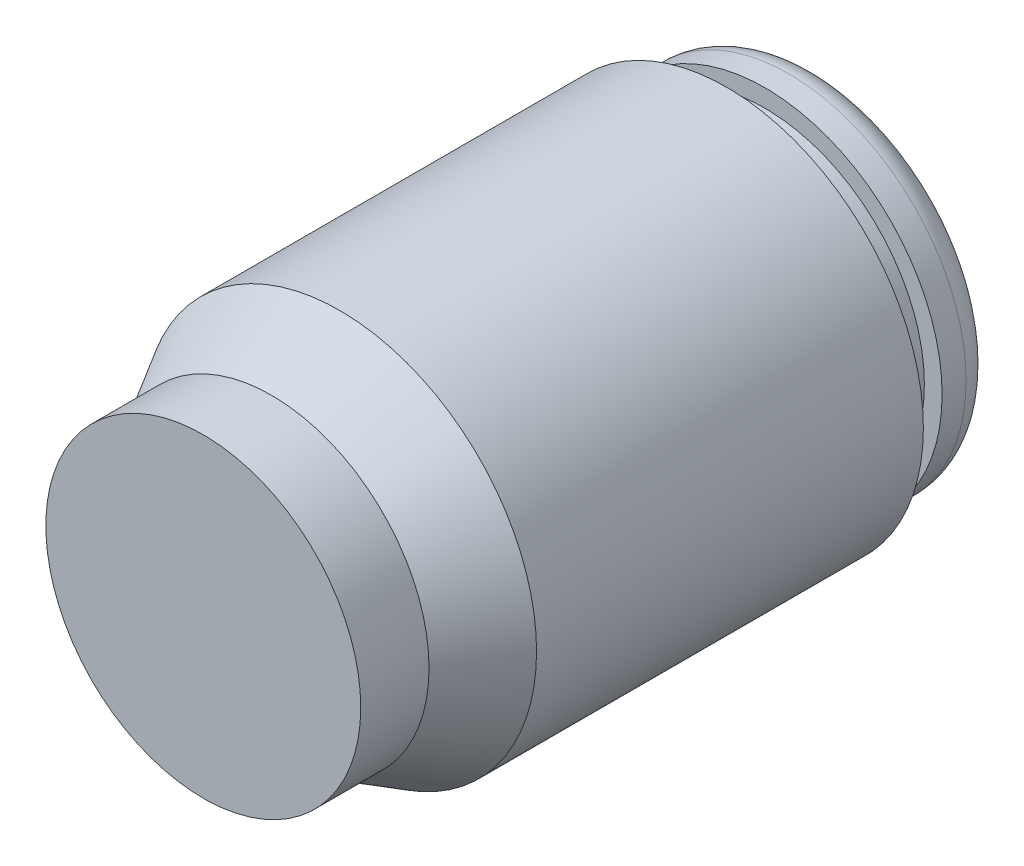
ISO-10303-21;
HEADER;
FILE_DESCRIPTION(('STEP AP214'),'2;1');
FILE_NAME('part.step','',(''),(''),'','','');
FILE_SCHEMA(('AUTOMOTIVE_DESIGN { 1 0 10303 214 1 1 1 1 }'));
ENDSEC;
DATA;
#1=APPLICATION_CONTEXT('core data for automotive mechanical design processes');
#2=APPLICATION_PROTOCOL_DEFINITION('international standard','automotive_design',2000,#1);
#3=PRODUCT_CONTEXT('',#1,'mechanical');
#4=PRODUCT('Part','Part','',(#3));
#5=PRODUCT_RELATED_PRODUCT_CATEGORY('part','',(#4));
#6=PRODUCT_DEFINITION_FORMATION('','',#4);
#7=PRODUCT_DEFINITION_CONTEXT('part definition',#1,'design');
#8=PRODUCT_DEFINITION('design','',#6,#7);
#9=PRODUCT_DEFINITION_SHAPE('','',#8);
#10=(LENGTH_UNIT() NAMED_UNIT(*) SI_UNIT(.MILLI.,.METRE.));
#11=(NAMED_UNIT(*) PLANE_ANGLE_UNIT() SI_UNIT($,.RADIAN.));
#12=(NAMED_UNIT(*) SI_UNIT($,.STERADIAN.) SOLID_ANGLE_UNIT());
#13=UNCERTAINTY_MEASURE_WITH_UNIT(LENGTH_MEASURE(1.E-05),#10,'distance_accuracy_value','');
#14=(GEOMETRIC_REPRESENTATION_CONTEXT(3) GLOBAL_UNCERTAINTY_ASSIGNED_CONTEXT((#13)) GLOBAL_UNIT_ASSIGNED_CONTEXT((#10,
#11,#12)) REPRESENTATION_CONTEXT('',''));
#15=CARTESIAN_POINT('',(0.,0.,0.));
#16=DIRECTION('',(0.,0.,1.));
#17=DIRECTION('',(1.,0.,0.));
#18=AXIS2_PLACEMENT_3D('',#15,#16,#17);
#19=CARTESIAN_POINT('',(0.,0.,-3.60997993322444));
#20=DIRECTION('',(0.,0.,-1.));
#21=DIRECTION('',(-1.,0.,0.));
#22=AXIS2_PLACEMENT_3D('',#19,#20,#21);
#23=CONICAL_SURFACE('',#22,5.207,0.5235987755983);
#24=CARTESIAN_POINT('',(0.,0.,-1.80622222222222));
#25=DIRECTION('',(0.,0.,1.));
#26=DIRECTION('',(1.,0.,0.));
#27=AXIS2_PLACEMENT_3D('',#24,#25,#26);
#28=CIRCLE('',#27,4.1656);
#29=CARTESIAN_POINT('',(4.1656,0.,-1.80622222222222));
#30=VERTEX_POINT('',#29);
#31=EDGE_CURVE('E74',#30,#30,#28,.T.);
#32=ORIENTED_EDGE('',*,*,#31,.F.);
#33=EDGE_LOOP('',(#32));
#34=FACE_BOUND('',#33,.T.);
#35=CARTESIAN_POINT('',(0.,0.,-3.60997993322444));
#36=DIRECTION('',(0.,0.,1.));
#37=DIRECTION('',(1.,0.,0.));
#38=AXIS2_PLACEMENT_3D('',#35,#36,#37);
#39=CIRCLE('',#38,5.207);
#40=CARTESIAN_POINT('',(5.207,0.,-3.60997993322444));
#41=VERTEX_POINT('',#40);
#42=EDGE_CURVE('E10',#41,#41,#39,.T.);
#43=ORIENTED_EDGE('',*,*,#42,.T.);
#44=EDGE_LOOP('',(#43));
#45=FACE_BOUND('',#44,.T.);
#46=ADVANCED_FACE('F34',(#34,#45),#23,.T.);
#47=CARTESIAN_POINT('',(0.,0.,0.));
#48=DIRECTION('',(0.,0.,1.));
#49=DIRECTION('',(1.,0.,0.));
#50=AXIS2_PLACEMENT_3D('',#47,#48,#49);
#51=CYLINDRICAL_SURFACE('',#50,5.207);
#52=ORIENTED_EDGE('',*,*,#42,.F.);
#53=EDGE_LOOP('',(#52));
#54=FACE_BOUND('',#53,.T.);
#55=CARTESIAN_POINT('',(0.,0.,-13.843));
#56=DIRECTION('',(0.,0.,1.));
#57=DIRECTION('',(1.,0.,0.));
#58=AXIS2_PLACEMENT_3D('',#55,#56,#57);
#59=CIRCLE('',#58,5.207);
#60=CARTESIAN_POINT('',(5.207,0.,-13.843));
#61=VERTEX_POINT('',#60);
#62=EDGE_CURVE('E40',#61,#61,#59,.T.);
#63=ORIENTED_EDGE('',*,*,#62,.T.);
#64=EDGE_LOOP('',(#63));
#65=FACE_BOUND('',#64,.T.);
#66=ADVANCED_FACE('F81',(#54,#65),#51,.T.);
#67=CARTESIAN_POINT('',(0.,5.207,-13.843));
#68=DIRECTION('',(0.,0.,1.));
#69=DIRECTION('',(1.,0.,0.));
#70=AXIS2_PLACEMENT_3D('',#67,#68,#69);
#71=PLANE('',#70);
#72=ORIENTED_EDGE('',*,*,#62,.F.);
#73=EDGE_LOOP('',(#72));
#74=FACE_BOUND('',#73,.T.);
#75=CARTESIAN_POINT('',(0.,0.,-13.843));
#76=DIRECTION('',(0.,0.,1.));
#77=DIRECTION('',(1.,0.,0.));
#78=AXIS2_PLACEMENT_3D('',#75,#76,#77);
#79=CIRCLE('',#78,4.21767);
#80=CARTESIAN_POINT('',(4.21767,0.,-13.843));
#81=VERTEX_POINT('',#80);
#82=EDGE_CURVE('E44',#81,#81,#79,.T.);
#83=ORIENTED_EDGE('',*,*,#82,.T.);
#84=EDGE_LOOP('',(#83));
#85=FACE_BOUND('',#84,.T.);
#86=ADVANCED_FACE('F85',(#74,#85),#71,.F.);
#87=CARTESIAN_POINT('',(0.,0.,0.));
#88=DIRECTION('',(0.,0.,1.));
#89=DIRECTION('',(1.,0.,0.));
#90=AXIS2_PLACEMENT_3D('',#87,#88,#89);
#91=CYLINDRICAL_SURFACE('',#90,4.21767);
#92=ORIENTED_EDGE('',*,*,#82,.F.);
#93=EDGE_LOOP('',(#92));
#94=FACE_BOUND('',#93,.T.);
#95=CARTESIAN_POINT('',(0.,0.,-14.859));
#96=DIRECTION('',(0.,0.,1.));
#97=DIRECTION('',(1.,0.,0.));
#98=AXIS2_PLACEMENT_3D('',#95,#96,#97);
#99=CIRCLE('',#98,4.21767);
#100=CARTESIAN_POINT('',(4.21767,0.,-14.859));
#101=VERTEX_POINT('',#100);
#102=EDGE_CURVE('E48',#101,#101,#99,.T.);
#103=ORIENTED_EDGE('',*,*,#102,.T.);
#104=EDGE_LOOP('',(#103));
#105=FACE_BOUND('',#104,.T.);
#106=ADVANCED_FACE('F90',(#94,#105),#91,.T.);
#107=CARTESIAN_POINT('',(0.,4.6863,-14.859));
#108=DIRECTION('',(0.,0.,-1.));
#109=DIRECTION('',(-1.,0.,0.));
#110=AXIS2_PLACEMENT_3D('',#107,#108,#109);
#111=PLANE('',#110);
#112=ORIENTED_EDGE('',*,*,#102,.F.);
#113=EDGE_LOOP('',(#112));
#114=FACE_BOUND('',#113,.T.);
#115=CARTESIAN_POINT('',(0.,0.,-14.859));
#116=DIRECTION('',(0.,0.,1.));
#117=DIRECTION('',(1.,0.,0.));
#118=AXIS2_PLACEMENT_3D('',#115,#116,#117);
#119=CIRCLE('',#118,4.6863);
#120=CARTESIAN_POINT('',(4.6863,0.,-14.859));
#121=VERTEX_POINT('',#120);
#122=EDGE_CURVE('E53',#121,#121,#119,.T.);
#123=ORIENTED_EDGE('',*,*,#122,.T.);
#124=EDGE_LOOP('',(#123));
#125=FACE_BOUND('',#124,.T.);
#126=ADVANCED_FACE('F96',(#114,#125),#111,.F.);
#127=CARTESIAN_POINT('',(0.,0.,0.));
#128=DIRECTION('',(0.,0.,1.));
#129=DIRECTION('',(1.,0.,0.));
#130=AXIS2_PLACEMENT_3D('',#127,#128,#129);
#131=CYLINDRICAL_SURFACE('',#130,4.6863);
#132=ORIENTED_EDGE('',*,*,#122,.F.);
#133=EDGE_LOOP('',(#132));
#134=FACE_BOUND('',#133,.T.);
#135=CARTESIAN_POINT('',(0.,0.,-15.494));
#136=DIRECTION('',(0.,0.,1.));
#137=DIRECTION('',(1.,0.,0.));
#138=AXIS2_PLACEMENT_3D('',#135,#136,#137);
#139=CIRCLE('',#138,4.6863);
#140=CARTESIAN_POINT('',(4.6863,0.,-15.494));
#141=VERTEX_POINT('',#140);
#142=EDGE_CURVE('E56',#141,#141,#139,.T.);
#143=ORIENTED_EDGE('',*,*,#142,.T.);
#144=EDGE_LOOP('',(#143));
#145=FACE_BOUND('',#144,.T.);
#146=ADVANCED_FACE('F100',(#134,#145),#131,.T.);
#147=CARTESIAN_POINT('',(0.,0.,-15.494));
#148=DIRECTION('',(0.,0.,1.));
#149=DIRECTION('',(1.,0.,0.));
#150=AXIS2_PLACEMENT_3D('',#147,#148,#149);
#151=TOROIDAL_SURFACE('',#150,3.9243,0.762000000000001);
#152=ORIENTED_EDGE('',*,*,#142,.F.);
#153=EDGE_LOOP('',(#152));
#154=FACE_BOUND('',#153,.T.);
#155=CARTESIAN_POINT('',(0.,0.,-16.256));
#156=DIRECTION('',(0.,0.,1.));
#157=DIRECTION('',(1.,0.,0.));
#158=AXIS2_PLACEMENT_3D('',#155,#156,#157);
#159=CIRCLE('',#158,3.9243);
#160=CARTESIAN_POINT('',(3.9243,0.,-16.256));
#161=VERTEX_POINT('',#160);
#162=EDGE_CURVE('E59',#161,#161,#159,.T.);
#163=ORIENTED_EDGE('',*,*,#162,.T.);
#164=EDGE_LOOP('',(#163));
#165=FACE_BOUND('',#164,.T.);
#166=ADVANCED_FACE('F104',(#154,#165),#151,.T.);
#167=CARTESIAN_POINT('',(0.,3.9243,-16.256));
#168=DIRECTION('',(0.,0.,1.));
#169=DIRECTION('',(1.,0.,0.));
#170=AXIS2_PLACEMENT_3D('',#167,#168,#169);
#171=PLANE('',#170);
#172=ORIENTED_EDGE('',*,*,#162,.F.);
#173=EDGE_LOOP('',(#172));
#174=FACE_BOUND('',#173,.T.);
#175=CARTESIAN_POINT('',(0.,0.,-16.256));
#176=DIRECTION('',(0.,0.,1.));
#177=DIRECTION('',(1.,0.,0.));
#178=AXIS2_PLACEMENT_3D('',#175,#176,#177);
#179=CIRCLE('',#178,3.556);
#180=CARTESIAN_POINT('',(3.556,0.,-16.256));
#181=VERTEX_POINT('',#180);
#182=EDGE_CURVE('E62',#181,#181,#179,.T.);
#183=ORIENTED_EDGE('',*,*,#182,.T.);
#184=EDGE_LOOP('',(#183));
#185=FACE_BOUND('',#184,.T.);
#186=ADVANCED_FACE('F108',(#174,#185),#171,.F.);
#187=CARTESIAN_POINT('',(0.,0.,-15.875));
#188=DIRECTION('',(0.,0.,-1.));
#189=DIRECTION('',(-1.,0.,0.));
#190=AXIS2_PLACEMENT_3D('',#187,#188,#189);
#191=CONICAL_SURFACE('',#190,3.175,0.785398163397449);
#192=ORIENTED_EDGE('',*,*,#182,.F.);
#193=EDGE_LOOP('',(#192));
#194=FACE_BOUND('',#193,.T.);
#195=CARTESIAN_POINT('',(0.,0.,-15.875));
#196=DIRECTION('',(0.,0.,1.));
#197=DIRECTION('',(1.,0.,0.));
#198=AXIS2_PLACEMENT_3D('',#195,#196,#197);
#199=CIRCLE('',#198,3.175);
#200=CARTESIAN_POINT('',(3.175,0.,-15.875));
#201=VERTEX_POINT('',#200);
#202=EDGE_CURVE('E65',#201,#201,#199,.T.);
#203=ORIENTED_EDGE('',*,*,#202,.T.);
#204=EDGE_LOOP('',(#203));
#205=FACE_BOUND('',#204,.T.);
#206=ADVANCED_FACE('F112',(#194,#205),#191,.F.);
#207=CARTESIAN_POINT('',(0.,0.,0.));
#208=DIRECTION('',(0.,0.,1.));
#209=DIRECTION('',(1.,0.,0.));
#210=AXIS2_PLACEMENT_3D('',#207,#208,#209);
#211=CYLINDRICAL_SURFACE('',#210,3.175);
#212=ORIENTED_EDGE('',*,*,#202,.F.);
#213=EDGE_LOOP('',(#212));
#214=FACE_BOUND('',#213,.T.);
#215=CARTESIAN_POINT('',(0.,0.,-3.60997993322444));
#216=DIRECTION('',(0.,0.,1.));
#217=DIRECTION('',(1.,0.,0.));
#218=AXIS2_PLACEMENT_3D('',#215,#216,#217);
#219=CIRCLE('',#218,3.175);
#220=CARTESIAN_POINT('',(3.175,0.,-3.60997993322444));
#221=VERTEX_POINT('',#220);
#222=EDGE_CURVE('E68',#221,#221,#219,.T.);
#223=ORIENTED_EDGE('',*,*,#222,.T.);
#224=EDGE_LOOP('',(#223));
#225=FACE_BOUND('',#224,.T.);
#226=ADVANCED_FACE('F116',(#214,#225),#211,.F.);
#227=CARTESIAN_POINT('',(0.,3.175,-3.60997993322445));
#228=DIRECTION('',(0.,0.,1.));
#229=DIRECTION('',(1.,0.,0.));
#230=AXIS2_PLACEMENT_3D('',#227,#228,#229);
#231=PLANE('',#230);
#232=ORIENTED_EDGE('',*,*,#222,.F.);
#233=EDGE_LOOP('',(#232));
#234=FACE_BOUND('',#233,.T.);
#235=ADVANCED_FACE('F120',(#234),#231,.F.);
#236=CARTESIAN_POINT('',(0.,4.1656,0.));
#237=DIRECTION('',(0.,0.,-1.));
#238=DIRECTION('',(-1.,0.,0.));
#239=AXIS2_PLACEMENT_3D('',#236,#237,#238);
#240=PLANE('',#239);
#241=CARTESIAN_POINT('',(0.,0.,0.));
#242=DIRECTION('',(0.,0.,1.));
#243=DIRECTION('',(1.,0.,0.));
#244=AXIS2_PLACEMENT_3D('',#241,#242,#243);
#245=CIRCLE('',#244,4.1656);
#246=CARTESIAN_POINT('',(4.1656,0.,0.));
#247=VERTEX_POINT('',#246);
#248=EDGE_CURVE('E71',#247,#247,#245,.T.);
#249=ORIENTED_EDGE('',*,*,#248,.T.);
#250=EDGE_LOOP('',(#249));
#251=FACE_BOUND('',#250,.T.);
#252=ADVANCED_FACE('F124',(#251),#240,.F.);
#253=CARTESIAN_POINT('',(0.,0.,0.));
#254=DIRECTION('',(0.,0.,1.));
#255=DIRECTION('',(1.,0.,0.));
#256=AXIS2_PLACEMENT_3D('',#253,#254,#255);
#257=CYLINDRICAL_SURFACE('',#256,4.1656);
#258=ORIENTED_EDGE('',*,*,#248,.F.);
#259=EDGE_LOOP('',(#258));
#260=FACE_BOUND('',#259,.T.);
#261=ORIENTED_EDGE('',*,*,#31,.T.);
#262=EDGE_LOOP('',(#261));
#263=FACE_BOUND('',#262,.T.);
#264=ADVANCED_FACE('F78',(#260,#263),#257,.T.);
#265=CLOSED_SHELL('',(#46,#66,#86,#106,#126,#146,#166,#186,#206,#226,#235,#252,#264));
#266=MANIFOLD_SOLID_BREP('B2',#265);
#267=ADVANCED_BREP_SHAPE_REPRESENTATION('',(#18,#266),#14);
#268=SHAPE_DEFINITION_REPRESENTATION(#9,#267);
ENDSEC;
END-ISO-10303-21;
